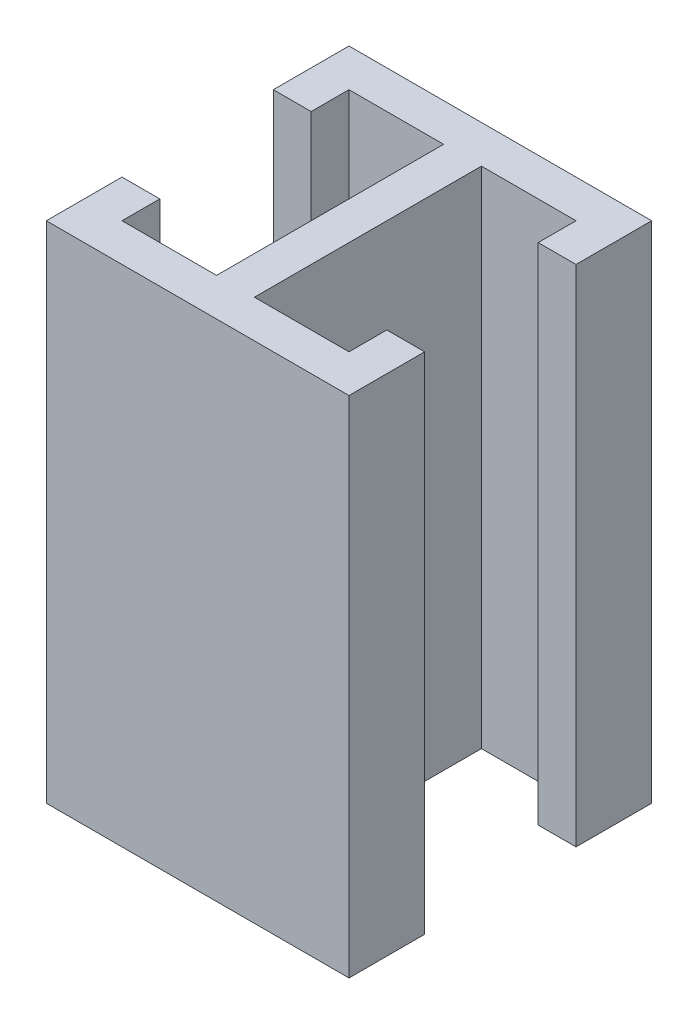
ISO-10303-21;
HEADER;
FILE_DESCRIPTION(('STEP AP214'),'2;1');
FILE_NAME('part.step','',(''),(''),'','','');
FILE_SCHEMA(('AUTOMOTIVE_DESIGN { 1 0 10303 214 1 1 1 1 }'));
ENDSEC;
DATA;
#1=APPLICATION_CONTEXT('core data for automotive mechanical design processes');
#2=APPLICATION_PROTOCOL_DEFINITION('international standard','automotive_design',2000,#1);
#3=PRODUCT_CONTEXT('',#1,'mechanical');
#4=PRODUCT('Part','Part','',(#3));
#5=PRODUCT_RELATED_PRODUCT_CATEGORY('part','',(#4));
#6=PRODUCT_DEFINITION_FORMATION('','',#4);
#7=PRODUCT_DEFINITION_CONTEXT('part definition',#1,'design');
#8=PRODUCT_DEFINITION('design','',#6,#7);
#9=PRODUCT_DEFINITION_SHAPE('','',#8);
#10=(LENGTH_UNIT() NAMED_UNIT(*) SI_UNIT(.MILLI.,.METRE.));
#11=(NAMED_UNIT(*) PLANE_ANGLE_UNIT() SI_UNIT($,.RADIAN.));
#12=(NAMED_UNIT(*) SI_UNIT($,.STERADIAN.) SOLID_ANGLE_UNIT());
#13=UNCERTAINTY_MEASURE_WITH_UNIT(LENGTH_MEASURE(1.E-05),#10,'distance_accuracy_value','');
#14=(GEOMETRIC_REPRESENTATION_CONTEXT(3) GLOBAL_UNCERTAINTY_ASSIGNED_CONTEXT((#13)) GLOBAL_UNIT_ASSIGNED_CONTEXT((#10,
#11,#12)) REPRESENTATION_CONTEXT('',''));
#15=CARTESIAN_POINT('',(0.,0.,0.));
#16=DIRECTION('',(0.,0.,1.));
#17=DIRECTION('',(1.,0.,0.));
#18=AXIS2_PLACEMENT_3D('',#15,#16,#17);
#19=CARTESIAN_POINT('',(0.,200.,0.));
#20=DIRECTION('',(1.,0.,0.));
#21=DIRECTION('',(0.,0.,-1.));
#22=AXIS2_PLACEMENT_3D('',#19,#20,#21);
#23=PLANE('',#22);
#24=DIRECTION('',(0.,0.,1.));
#25=VECTOR('',#24,1.);
#26=CARTESIAN_POINT('',(0.,0.,0.));
#27=LINE('',#26,#25);
#28=CARTESIAN_POINT('',(0.,0.,-30.));
#29=VERTEX_POINT('',#28);
#30=CARTESIAN_POINT('',(0.,0.,0.));
#31=VERTEX_POINT('',#30);
#32=EDGE_CURVE('E206',#29,#31,#27,.T.);
#33=ORIENTED_EDGE('',*,*,#32,.T.);
#34=DIRECTION('',(0.,-1.,0.));
#35=VECTOR('',#34,1.);
#36=CARTESIAN_POINT('',(0.,200.,0.));
#37=LINE('',#36,#35);
#38=CARTESIAN_POINT('',(0.,200.,0.));
#39=VERTEX_POINT('',#38);
#40=EDGE_CURVE('E11',#39,#31,#37,.T.);
#41=ORIENTED_EDGE('',*,*,#40,.F.);
#42=DIRECTION('',(0.,0.,1.));
#43=VECTOR('',#42,1.);
#44=CARTESIAN_POINT('',(0.,200.,0.));
#45=LINE('',#44,#43);
#46=CARTESIAN_POINT('',(0.,200.,-30.));
#47=VERTEX_POINT('',#46);
#48=EDGE_CURVE('E244',#47,#39,#45,.T.);
#49=ORIENTED_EDGE('',*,*,#48,.F.);
#50=DIRECTION('',(0.,-1.,0.));
#51=VECTOR('',#50,1.);
#52=CARTESIAN_POINT('',(0.,200.,-30.));
#53=LINE('',#52,#51);
#54=EDGE_CURVE('E202',#47,#29,#53,.T.);
#55=ORIENTED_EDGE('',*,*,#54,.T.);
#56=EDGE_LOOP('',(#33,#41,#49,#55));
#57=FACE_BOUND('',#56,.T.);
#58=ADVANCED_FACE('F38',(#57),#23,.F.);
#59=CARTESIAN_POINT('',(0.,200.,0.));
#60=DIRECTION('',(0.,0.,-1.));
#61=DIRECTION('',(-1.,0.,0.));
#62=AXIS2_PLACEMENT_3D('',#59,#60,#61);
#63=PLANE('',#62);
#64=DIRECTION('',(1.,0.,0.));
#65=VECTOR('',#64,1.);
#66=CARTESIAN_POINT('',(0.,0.,0.));
#67=LINE('',#66,#65);
#68=CARTESIAN_POINT('',(120.,0.,0.));
#69=VERTEX_POINT('',#68);
#70=EDGE_CURVE('E209',#31,#69,#67,.T.);
#71=ORIENTED_EDGE('',*,*,#70,.T.);
#72=DIRECTION('',(0.,-1.,0.));
#73=VECTOR('',#72,1.);
#74=CARTESIAN_POINT('',(120.,200.,0.));
#75=LINE('',#74,#73);
#76=CARTESIAN_POINT('',(120.,200.,0.));
#77=VERTEX_POINT('',#76);
#78=EDGE_CURVE('E46',#77,#69,#75,.T.);
#79=ORIENTED_EDGE('',*,*,#78,.F.);
#80=DIRECTION('',(1.,0.,0.));
#81=VECTOR('',#80,1.);
#82=CARTESIAN_POINT('',(0.,200.,0.));
#83=LINE('',#82,#81);
#84=EDGE_CURVE('E133',#39,#77,#83,.T.);
#85=ORIENTED_EDGE('',*,*,#84,.F.);
#86=ORIENTED_EDGE('',*,*,#40,.T.);
#87=EDGE_LOOP('',(#71,#79,#85,#86));
#88=FACE_BOUND('',#87,.T.);
#89=ADVANCED_FACE('F362',(#88),#63,.F.);
#90=CARTESIAN_POINT('',(120.,200.,0.));
#91=DIRECTION('',(-1.,0.,0.));
#92=DIRECTION('',(0.,0.,1.));
#93=AXIS2_PLACEMENT_3D('',#90,#91,#92);
#94=PLANE('',#93);
#95=DIRECTION('',(0.,0.,-1.));
#96=VECTOR('',#95,1.);
#97=CARTESIAN_POINT('',(120.,0.,0.));
#98=LINE('',#97,#96);
#99=CARTESIAN_POINT('',(120.,0.,-30.));
#100=VERTEX_POINT('',#99);
#101=EDGE_CURVE('E211',#69,#100,#98,.T.);
#102=ORIENTED_EDGE('',*,*,#101,.T.);
#103=DIRECTION('',(0.,-1.,0.));
#104=VECTOR('',#103,1.);
#105=CARTESIAN_POINT('',(120.,200.,-30.));
#106=LINE('',#105,#104);
#107=CARTESIAN_POINT('',(120.,200.,-30.));
#108=VERTEX_POINT('',#107);
#109=EDGE_CURVE('E287',#108,#100,#106,.T.);
#110=ORIENTED_EDGE('',*,*,#109,.F.);
#111=DIRECTION('',(0.,0.,-1.));
#112=VECTOR('',#111,1.);
#113=CARTESIAN_POINT('',(120.,200.,0.));
#114=LINE('',#113,#112);
#115=EDGE_CURVE('E295',#77,#108,#114,.T.);
#116=ORIENTED_EDGE('',*,*,#115,.F.);
#117=ORIENTED_EDGE('',*,*,#78,.T.);
#118=EDGE_LOOP('',(#102,#110,#116,#117));
#119=FACE_BOUND('',#118,.T.);
#120=ADVANCED_FACE('F293',(#119),#94,.F.);
#121=CARTESIAN_POINT('',(105.,200.,-30.));
#122=DIRECTION('',(0.,0.,1.));
#123=DIRECTION('',(1.,0.,0.));
#124=AXIS2_PLACEMENT_3D('',#121,#122,#123);
#125=PLANE('',#124);
#126=DIRECTION('',(-1.,0.,0.));
#127=VECTOR('',#126,1.);
#128=CARTESIAN_POINT('',(105.,0.,-30.));
#129=LINE('',#128,#127);
#130=CARTESIAN_POINT('',(105.,0.,-30.));
#131=VERTEX_POINT('',#130);
#132=EDGE_CURVE('E213',#100,#131,#129,.T.);
#133=ORIENTED_EDGE('',*,*,#132,.T.);
#134=DIRECTION('',(0.,-1.,0.));
#135=VECTOR('',#134,1.);
#136=CARTESIAN_POINT('',(105.,200.,-30.));
#137=LINE('',#136,#135);
#138=CARTESIAN_POINT('',(105.,200.,-30.));
#139=VERTEX_POINT('',#138);
#140=EDGE_CURVE('E284',#139,#131,#137,.T.);
#141=ORIENTED_EDGE('',*,*,#140,.F.);
#142=DIRECTION('',(-1.,0.,0.));
#143=VECTOR('',#142,1.);
#144=CARTESIAN_POINT('',(105.,200.,-30.));
#145=LINE('',#144,#143);
#146=EDGE_CURVE('E313',#108,#139,#145,.T.);
#147=ORIENTED_EDGE('',*,*,#146,.F.);
#148=ORIENTED_EDGE('',*,*,#109,.T.);
#149=EDGE_LOOP('',(#133,#141,#147,#148));
#150=FACE_BOUND('',#149,.T.);
#151=ADVANCED_FACE('F304',(#150),#125,.F.);
#152=CARTESIAN_POINT('',(105.,200.,-30.));
#153=DIRECTION('',(1.,0.,0.));
#154=DIRECTION('',(0.,0.,-1.));
#155=AXIS2_PLACEMENT_3D('',#152,#153,#154);
#156=PLANE('',#155);
#157=DIRECTION('',(0.,0.,1.));
#158=VECTOR('',#157,1.);
#159=CARTESIAN_POINT('',(105.,0.,-30.));
#160=LINE('',#159,#158);
#161=CARTESIAN_POINT('',(105.,0.,-15.));
#162=VERTEX_POINT('',#161);
#163=EDGE_CURVE('E215',#131,#162,#160,.T.);
#164=ORIENTED_EDGE('',*,*,#163,.T.);
#165=DIRECTION('',(0.,-1.,0.));
#166=VECTOR('',#165,1.);
#167=CARTESIAN_POINT('',(105.,200.,-15.));
#168=LINE('',#167,#166);
#169=CARTESIAN_POINT('',(105.,200.,-15.));
#170=VERTEX_POINT('',#169);
#171=EDGE_CURVE('E281',#170,#162,#168,.T.);
#172=ORIENTED_EDGE('',*,*,#171,.F.);
#173=DIRECTION('',(0.,0.,1.));
#174=VECTOR('',#173,1.);
#175=CARTESIAN_POINT('',(105.,200.,-30.));
#176=LINE('',#175,#174);
#177=EDGE_CURVE('E310',#139,#170,#176,.T.);
#178=ORIENTED_EDGE('',*,*,#177,.F.);
#179=ORIENTED_EDGE('',*,*,#140,.T.);
#180=EDGE_LOOP('',(#164,#172,#178,#179));
#181=FACE_BOUND('',#180,.T.);
#182=ADVANCED_FACE('F308',(#181),#156,.F.);
#183=CARTESIAN_POINT('',(67.5,200.,-15.));
#184=DIRECTION('',(0.,0.,1.));
#185=DIRECTION('',(1.,0.,0.));
#186=AXIS2_PLACEMENT_3D('',#183,#184,#185);
#187=PLANE('',#186);
#188=DIRECTION('',(-1.,0.,0.));
#189=VECTOR('',#188,1.);
#190=CARTESIAN_POINT('',(67.5,0.,-15.));
#191=LINE('',#190,#189);
#192=CARTESIAN_POINT('',(67.5,0.,-15.));
#193=VERTEX_POINT('',#192);
#194=EDGE_CURVE('E217',#162,#193,#191,.T.);
#195=ORIENTED_EDGE('',*,*,#194,.T.);
#196=DIRECTION('',(0.,-1.,0.));
#197=VECTOR('',#196,1.);
#198=CARTESIAN_POINT('',(67.5,200.,-15.));
#199=LINE('',#198,#197);
#200=CARTESIAN_POINT('',(67.5,200.,-15.));
#201=VERTEX_POINT('',#200);
#202=EDGE_CURVE('E278',#201,#193,#199,.T.);
#203=ORIENTED_EDGE('',*,*,#202,.F.);
#204=DIRECTION('',(-1.,0.,0.));
#205=VECTOR('',#204,1.);
#206=CARTESIAN_POINT('',(67.5,200.,-15.));
#207=LINE('',#206,#205);
#208=EDGE_CURVE('E312',#170,#201,#207,.T.);
#209=ORIENTED_EDGE('',*,*,#208,.F.);
#210=ORIENTED_EDGE('',*,*,#171,.T.);
#211=EDGE_LOOP('',(#195,#203,#209,#210));
#212=FACE_BOUND('',#211,.T.);
#213=ADVANCED_FACE('F375',(#212),#187,.F.);
#214=CARTESIAN_POINT('',(67.5,200.,-105.));
#215=DIRECTION('',(-1.,0.,0.));
#216=DIRECTION('',(0.,0.,1.));
#217=AXIS2_PLACEMENT_3D('',#214,#215,#216);
#218=PLANE('',#217);
#219=DIRECTION('',(0.,0.,-1.));
#220=VECTOR('',#219,1.);
#221=CARTESIAN_POINT('',(67.5,0.,-105.));
#222=LINE('',#221,#220);
#223=CARTESIAN_POINT('',(67.5,0.,-105.));
#224=VERTEX_POINT('',#223);
#225=EDGE_CURVE('E219',#193,#224,#222,.T.);
#226=ORIENTED_EDGE('',*,*,#225,.T.);
#227=DIRECTION('',(0.,-1.,0.));
#228=VECTOR('',#227,1.);
#229=CARTESIAN_POINT('',(67.5,200.,-105.));
#230=LINE('',#229,#228);
#231=CARTESIAN_POINT('',(67.5,200.,-105.));
#232=VERTEX_POINT('',#231);
#233=EDGE_CURVE('E275',#232,#224,#230,.T.);
#234=ORIENTED_EDGE('',*,*,#233,.F.);
#235=DIRECTION('',(0.,0.,-1.));
#236=VECTOR('',#235,1.);
#237=CARTESIAN_POINT('',(67.5,200.,-105.));
#238=LINE('',#237,#236);
#239=EDGE_CURVE('E315',#201,#232,#238,.T.);
#240=ORIENTED_EDGE('',*,*,#239,.F.);
#241=ORIENTED_EDGE('',*,*,#202,.T.);
#242=EDGE_LOOP('',(#226,#234,#240,#241));
#243=FACE_BOUND('',#242,.T.);
#244=ADVANCED_FACE('F378',(#243),#218,.F.);
#245=CARTESIAN_POINT('',(67.5,200.,-105.));
#246=DIRECTION('',(0.,0.,-1.));
#247=DIRECTION('',(-1.,0.,0.));
#248=AXIS2_PLACEMENT_3D('',#245,#246,#247);
#249=PLANE('',#248);
#250=DIRECTION('',(1.,0.,0.));
#251=VECTOR('',#250,1.);
#252=CARTESIAN_POINT('',(67.5,0.,-105.));
#253=LINE('',#252,#251);
#254=CARTESIAN_POINT('',(105.,0.,-105.));
#255=VERTEX_POINT('',#254);
#256=EDGE_CURVE('E221',#224,#255,#253,.T.);
#257=ORIENTED_EDGE('',*,*,#256,.T.);
#258=DIRECTION('',(0.,-1.,0.));
#259=VECTOR('',#258,1.);
#260=CARTESIAN_POINT('',(105.,200.,-105.));
#261=LINE('',#260,#259);
#262=CARTESIAN_POINT('',(105.,200.,-105.));
#263=VERTEX_POINT('',#262);
#264=EDGE_CURVE('E272',#263,#255,#261,.T.);
#265=ORIENTED_EDGE('',*,*,#264,.F.);
#266=DIRECTION('',(1.,0.,0.));
#267=VECTOR('',#266,1.);
#268=CARTESIAN_POINT('',(67.5,200.,-105.));
#269=LINE('',#268,#267);
#270=EDGE_CURVE('E321',#232,#263,#269,.T.);
#271=ORIENTED_EDGE('',*,*,#270,.F.);
#272=ORIENTED_EDGE('',*,*,#233,.T.);
#273=EDGE_LOOP('',(#257,#265,#271,#272));
#274=FACE_BOUND('',#273,.T.);
#275=ADVANCED_FACE('F382',(#274),#249,.F.);
#276=CARTESIAN_POINT('',(105.,200.,-105.));
#277=DIRECTION('',(1.,0.,0.));
#278=DIRECTION('',(0.,0.,-1.));
#279=AXIS2_PLACEMENT_3D('',#276,#277,#278);
#280=PLANE('',#279);
#281=DIRECTION('',(0.,0.,1.));
#282=VECTOR('',#281,1.);
#283=CARTESIAN_POINT('',(105.,0.,-105.));
#284=LINE('',#283,#282);
#285=CARTESIAN_POINT('',(105.,0.,-90.));
#286=VERTEX_POINT('',#285);
#287=EDGE_CURVE('E223',#255,#286,#284,.T.);
#288=ORIENTED_EDGE('',*,*,#287,.T.);
#289=DIRECTION('',(0.,-1.,0.));
#290=VECTOR('',#289,1.);
#291=CARTESIAN_POINT('',(105.,200.,-90.));
#292=LINE('',#291,#290);
#293=CARTESIAN_POINT('',(105.,200.,-90.));
#294=VERTEX_POINT('',#293);
#295=EDGE_CURVE('E269',#294,#286,#292,.T.);
#296=ORIENTED_EDGE('',*,*,#295,.F.);
#297=DIRECTION('',(0.,0.,1.));
#298=VECTOR('',#297,1.);
#299=CARTESIAN_POINT('',(105.,200.,-105.));
#300=LINE('',#299,#298);
#301=EDGE_CURVE('E323',#263,#294,#300,.T.);
#302=ORIENTED_EDGE('',*,*,#301,.F.);
#303=ORIENTED_EDGE('',*,*,#264,.T.);
#304=EDGE_LOOP('',(#288,#296,#302,#303));
#305=FACE_BOUND('',#304,.T.);
#306=ADVANCED_FACE('F386',(#305),#280,.F.);
#307=CARTESIAN_POINT('',(105.,200.,-90.));
#308=DIRECTION('',(0.,0.,-1.));
#309=DIRECTION('',(-1.,0.,0.));
#310=AXIS2_PLACEMENT_3D('',#307,#308,#309);
#311=PLANE('',#310);
#312=DIRECTION('',(1.,0.,0.));
#313=VECTOR('',#312,1.);
#314=CARTESIAN_POINT('',(105.,0.,-90.));
#315=LINE('',#314,#313);
#316=CARTESIAN_POINT('',(120.,0.,-90.));
#317=VERTEX_POINT('',#316);
#318=EDGE_CURVE('E225',#286,#317,#315,.T.);
#319=ORIENTED_EDGE('',*,*,#318,.T.);
#320=DIRECTION('',(0.,-1.,0.));
#321=VECTOR('',#320,1.);
#322=CARTESIAN_POINT('',(120.,200.,-90.));
#323=LINE('',#322,#321);
#324=CARTESIAN_POINT('',(120.,200.,-90.));
#325=VERTEX_POINT('',#324);
#326=EDGE_CURVE('E266',#325,#317,#323,.T.);
#327=ORIENTED_EDGE('',*,*,#326,.F.);
#328=DIRECTION('',(1.,0.,0.));
#329=VECTOR('',#328,1.);
#330=CARTESIAN_POINT('',(105.,200.,-90.));
#331=LINE('',#330,#329);
#332=EDGE_CURVE('E325',#294,#325,#331,.T.);
#333=ORIENTED_EDGE('',*,*,#332,.F.);
#334=ORIENTED_EDGE('',*,*,#295,.T.);
#335=EDGE_LOOP('',(#319,#327,#333,#334));
#336=FACE_BOUND('',#335,.T.);
#337=ADVANCED_FACE('F390',(#336),#311,.F.);
#338=CARTESIAN_POINT('',(120.,200.,-90.));
#339=DIRECTION('',(-1.,0.,0.));
#340=DIRECTION('',(0.,0.,1.));
#341=AXIS2_PLACEMENT_3D('',#338,#339,#340);
#342=PLANE('',#341);
#343=DIRECTION('',(0.,0.,-1.));
#344=VECTOR('',#343,1.);
#345=CARTESIAN_POINT('',(120.,0.,-90.));
#346=LINE('',#345,#344);
#347=CARTESIAN_POINT('',(120.,0.,-120.));
#348=VERTEX_POINT('',#347);
#349=EDGE_CURVE('E227',#317,#348,#346,.T.);
#350=ORIENTED_EDGE('',*,*,#349,.T.);
#351=DIRECTION('',(0.,-1.,0.));
#352=VECTOR('',#351,1.);
#353=CARTESIAN_POINT('',(120.,200.,-120.));
#354=LINE('',#353,#352);
#355=CARTESIAN_POINT('',(120.,200.,-120.));
#356=VERTEX_POINT('',#355);
#357=EDGE_CURVE('E263',#356,#348,#354,.T.);
#358=ORIENTED_EDGE('',*,*,#357,.F.);
#359=DIRECTION('',(0.,0.,-1.));
#360=VECTOR('',#359,1.);
#361=CARTESIAN_POINT('',(120.,200.,-90.));
#362=LINE('',#361,#360);
#363=EDGE_CURVE('E327',#325,#356,#362,.T.);
#364=ORIENTED_EDGE('',*,*,#363,.F.);
#365=ORIENTED_EDGE('',*,*,#326,.T.);
#366=EDGE_LOOP('',(#350,#358,#364,#365));
#367=FACE_BOUND('',#366,.T.);
#368=ADVANCED_FACE('F394',(#367),#342,.F.);
#369=CARTESIAN_POINT('',(0.,200.,-120.));
#370=DIRECTION('',(0.,0.,1.));
#371=DIRECTION('',(1.,0.,0.));
#372=AXIS2_PLACEMENT_3D('',#369,#370,#371);
#373=PLANE('',#372);
#374=DIRECTION('',(-1.,0.,0.));
#375=VECTOR('',#374,1.);
#376=CARTESIAN_POINT('',(0.,0.,-120.));
#377=LINE('',#376,#375);
#378=CARTESIAN_POINT('',(0.,0.,-120.));
#379=VERTEX_POINT('',#378);
#380=EDGE_CURVE('E229',#348,#379,#377,.T.);
#381=ORIENTED_EDGE('',*,*,#380,.T.);
#382=DIRECTION('',(0.,-1.,0.));
#383=VECTOR('',#382,1.);
#384=CARTESIAN_POINT('',(0.,200.,-120.));
#385=LINE('',#384,#383);
#386=CARTESIAN_POINT('',(0.,200.,-120.));
#387=VERTEX_POINT('',#386);
#388=EDGE_CURVE('E260',#387,#379,#385,.T.);
#389=ORIENTED_EDGE('',*,*,#388,.F.);
#390=DIRECTION('',(-1.,0.,0.));
#391=VECTOR('',#390,1.);
#392=CARTESIAN_POINT('',(0.,200.,-120.));
#393=LINE('',#392,#391);
#394=EDGE_CURVE('E329',#356,#387,#393,.T.);
#395=ORIENTED_EDGE('',*,*,#394,.F.);
#396=ORIENTED_EDGE('',*,*,#357,.T.);
#397=EDGE_LOOP('',(#381,#389,#395,#396));
#398=FACE_BOUND('',#397,.T.);
#399=ADVANCED_FACE('F398',(#398),#373,.F.);
#400=CARTESIAN_POINT('',(0.,200.,-90.));
#401=DIRECTION('',(1.,0.,0.));
#402=DIRECTION('',(0.,0.,-1.));
#403=AXIS2_PLACEMENT_3D('',#400,#401,#402);
#404=PLANE('',#403);
#405=DIRECTION('',(0.,0.,1.));
#406=VECTOR('',#405,1.);
#407=CARTESIAN_POINT('',(0.,0.,-90.));
#408=LINE('',#407,#406);
#409=CARTESIAN_POINT('',(0.,0.,-90.));
#410=VERTEX_POINT('',#409);
#411=EDGE_CURVE('E231',#379,#410,#408,.T.);
#412=ORIENTED_EDGE('',*,*,#411,.T.);
#413=DIRECTION('',(0.,-1.,0.));
#414=VECTOR('',#413,1.);
#415=CARTESIAN_POINT('',(0.,200.,-90.));
#416=LINE('',#415,#414);
#417=CARTESIAN_POINT('',(0.,200.,-90.));
#418=VERTEX_POINT('',#417);
#419=EDGE_CURVE('E257',#418,#410,#416,.T.);
#420=ORIENTED_EDGE('',*,*,#419,.F.);
#421=DIRECTION('',(0.,0.,1.));
#422=VECTOR('',#421,1.);
#423=CARTESIAN_POINT('',(0.,200.,-90.));
#424=LINE('',#423,#422);
#425=EDGE_CURVE('E331',#387,#418,#424,.T.);
#426=ORIENTED_EDGE('',*,*,#425,.F.);
#427=ORIENTED_EDGE('',*,*,#388,.T.);
#428=EDGE_LOOP('',(#412,#420,#426,#427));
#429=FACE_BOUND('',#428,.T.);
#430=ADVANCED_FACE('F402',(#429),#404,.F.);
#431=CARTESIAN_POINT('',(15.,200.,-90.));
#432=DIRECTION('',(0.,0.,-1.));
#433=DIRECTION('',(-1.,0.,0.));
#434=AXIS2_PLACEMENT_3D('',#431,#432,#433);
#435=PLANE('',#434);
#436=DIRECTION('',(1.,0.,0.));
#437=VECTOR('',#436,1.);
#438=CARTESIAN_POINT('',(15.,0.,-90.));
#439=LINE('',#438,#437);
#440=CARTESIAN_POINT('',(15.,0.,-90.));
#441=VERTEX_POINT('',#440);
#442=EDGE_CURVE('E233',#410,#441,#439,.T.);
#443=ORIENTED_EDGE('',*,*,#442,.T.);
#444=DIRECTION('',(0.,-1.,0.));
#445=VECTOR('',#444,1.);
#446=CARTESIAN_POINT('',(15.,200.,-90.));
#447=LINE('',#446,#445);
#448=CARTESIAN_POINT('',(15.,200.,-90.));
#449=VERTEX_POINT('',#448);
#450=EDGE_CURVE('E254',#449,#441,#447,.T.);
#451=ORIENTED_EDGE('',*,*,#450,.F.);
#452=DIRECTION('',(1.,0.,0.));
#453=VECTOR('',#452,1.);
#454=CARTESIAN_POINT('',(15.,200.,-90.));
#455=LINE('',#454,#453);
#456=EDGE_CURVE('E333',#418,#449,#455,.T.);
#457=ORIENTED_EDGE('',*,*,#456,.F.);
#458=ORIENTED_EDGE('',*,*,#419,.T.);
#459=EDGE_LOOP('',(#443,#451,#457,#458));
#460=FACE_BOUND('',#459,.T.);
#461=ADVANCED_FACE('F406',(#460),#435,.F.);
#462=CARTESIAN_POINT('',(15.,200.,-105.));
#463=DIRECTION('',(-1.,0.,0.));
#464=DIRECTION('',(0.,0.,1.));
#465=AXIS2_PLACEMENT_3D('',#462,#463,#464);
#466=PLANE('',#465);
#467=DIRECTION('',(0.,0.,-1.));
#468=VECTOR('',#467,1.);
#469=CARTESIAN_POINT('',(15.,0.,-105.));
#470=LINE('',#469,#468);
#471=CARTESIAN_POINT('',(15.,0.,-105.));
#472=VERTEX_POINT('',#471);
#473=EDGE_CURVE('E235',#441,#472,#470,.T.);
#474=ORIENTED_EDGE('',*,*,#473,.T.);
#475=DIRECTION('',(0.,-1.,0.));
#476=VECTOR('',#475,1.);
#477=CARTESIAN_POINT('',(15.,200.,-105.));
#478=LINE('',#477,#476);
#479=CARTESIAN_POINT('',(15.,200.,-105.));
#480=VERTEX_POINT('',#479);
#481=EDGE_CURVE('E251',#480,#472,#478,.T.);
#482=ORIENTED_EDGE('',*,*,#481,.F.);
#483=DIRECTION('',(0.,0.,-1.));
#484=VECTOR('',#483,1.);
#485=CARTESIAN_POINT('',(15.,200.,-105.));
#486=LINE('',#485,#484);
#487=EDGE_CURVE('E335',#449,#480,#486,.T.);
#488=ORIENTED_EDGE('',*,*,#487,.F.);
#489=ORIENTED_EDGE('',*,*,#450,.T.);
#490=EDGE_LOOP('',(#474,#482,#488,#489));
#491=FACE_BOUND('',#490,.T.);
#492=ADVANCED_FACE('F410',(#491),#466,.F.);
#493=CARTESIAN_POINT('',(52.5,200.,-105.));
#494=DIRECTION('',(0.,0.,-1.));
#495=DIRECTION('',(-1.,0.,0.));
#496=AXIS2_PLACEMENT_3D('',#493,#494,#495);
#497=PLANE('',#496);
#498=DIRECTION('',(1.,0.,0.));
#499=VECTOR('',#498,1.);
#500=CARTESIAN_POINT('',(52.5,0.,-105.));
#501=LINE('',#500,#499);
#502=CARTESIAN_POINT('',(52.5,0.,-105.));
#503=VERTEX_POINT('',#502);
#504=EDGE_CURVE('E237',#472,#503,#501,.T.);
#505=ORIENTED_EDGE('',*,*,#504,.T.);
#506=DIRECTION('',(0.,-1.,0.));
#507=VECTOR('',#506,1.);
#508=CARTESIAN_POINT('',(52.5,200.,-105.));
#509=LINE('',#508,#507);
#510=CARTESIAN_POINT('',(52.5,200.,-105.));
#511=VERTEX_POINT('',#510);
#512=EDGE_CURVE('E248',#511,#503,#509,.T.);
#513=ORIENTED_EDGE('',*,*,#512,.F.);
#514=DIRECTION('',(1.,0.,0.));
#515=VECTOR('',#514,1.);
#516=CARTESIAN_POINT('',(52.5,200.,-105.));
#517=LINE('',#516,#515);
#518=EDGE_CURVE('E337',#480,#511,#517,.T.);
#519=ORIENTED_EDGE('',*,*,#518,.F.);
#520=ORIENTED_EDGE('',*,*,#481,.T.);
#521=EDGE_LOOP('',(#505,#513,#519,#520));
#522=FACE_BOUND('',#521,.T.);
#523=ADVANCED_FACE('F343',(#522),#497,.F.);
#524=CARTESIAN_POINT('',(52.5,200.,-105.));
#525=DIRECTION('',(1.,0.,0.));
#526=DIRECTION('',(0.,0.,-1.));
#527=AXIS2_PLACEMENT_3D('',#524,#525,#526);
#528=PLANE('',#527);
#529=DIRECTION('',(0.,0.,1.));
#530=VECTOR('',#529,1.);
#531=CARTESIAN_POINT('',(52.5,0.,-105.));
#532=LINE('',#531,#530);
#533=CARTESIAN_POINT('',(52.5,0.,-15.));
#534=VERTEX_POINT('',#533);
#535=EDGE_CURVE('E239',#503,#534,#532,.T.);
#536=ORIENTED_EDGE('',*,*,#535,.T.);
#537=DIRECTION('',(0.,-1.,0.));
#538=VECTOR('',#537,1.);
#539=CARTESIAN_POINT('',(52.5,200.,-15.));
#540=LINE('',#539,#538);
#541=CARTESIAN_POINT('',(52.5,200.,-15.));
#542=VERTEX_POINT('',#541);
#543=EDGE_CURVE('E197',#542,#534,#540,.T.);
#544=ORIENTED_EDGE('',*,*,#543,.F.);
#545=DIRECTION('',(0.,0.,1.));
#546=VECTOR('',#545,1.);
#547=CARTESIAN_POINT('',(52.5,200.,-105.));
#548=LINE('',#547,#546);
#549=EDGE_CURVE('E188',#511,#542,#548,.T.);
#550=ORIENTED_EDGE('',*,*,#549,.F.);
#551=ORIENTED_EDGE('',*,*,#512,.T.);
#552=EDGE_LOOP('',(#536,#544,#550,#551));
#553=FACE_BOUND('',#552,.T.);
#554=ADVANCED_FACE('F347',(#553),#528,.F.);
#555=CARTESIAN_POINT('',(52.5,200.,-15.));
#556=DIRECTION('',(0.,0.,1.));
#557=DIRECTION('',(1.,0.,0.));
#558=AXIS2_PLACEMENT_3D('',#555,#556,#557);
#559=PLANE('',#558);
#560=DIRECTION('',(-1.,0.,0.));
#561=VECTOR('',#560,1.);
#562=CARTESIAN_POINT('',(52.5,0.,-15.));
#563=LINE('',#562,#561);
#564=CARTESIAN_POINT('',(15.,0.,-15.));
#565=VERTEX_POINT('',#564);
#566=EDGE_CURVE('E196',#534,#565,#563,.T.);
#567=ORIENTED_EDGE('',*,*,#566,.T.);
#568=DIRECTION('',(0.,-1.,0.));
#569=VECTOR('',#568,1.);
#570=CARTESIAN_POINT('',(15.,200.,-15.));
#571=LINE('',#570,#569);
#572=CARTESIAN_POINT('',(15.,200.,-15.));
#573=VERTEX_POINT('',#572);
#574=EDGE_CURVE('E193',#573,#565,#571,.T.);
#575=ORIENTED_EDGE('',*,*,#574,.F.);
#576=DIRECTION('',(-1.,0.,0.));
#577=VECTOR('',#576,1.);
#578=CARTESIAN_POINT('',(52.5,200.,-15.));
#579=LINE('',#578,#577);
#580=EDGE_CURVE('E182',#542,#573,#579,.T.);
#581=ORIENTED_EDGE('',*,*,#580,.F.);
#582=ORIENTED_EDGE('',*,*,#543,.T.);
#583=EDGE_LOOP('',(#567,#575,#581,#582));
#584=FACE_BOUND('',#583,.T.);
#585=ADVANCED_FACE('F194',(#584),#559,.F.);
#586=CARTESIAN_POINT('',(15.,200.,-30.));
#587=DIRECTION('',(-1.,0.,0.));
#588=DIRECTION('',(0.,0.,1.));
#589=AXIS2_PLACEMENT_3D('',#586,#587,#588);
#590=PLANE('',#589);
#591=DIRECTION('',(0.,0.,-1.));
#592=VECTOR('',#591,1.);
#593=CARTESIAN_POINT('',(15.,0.,-30.));
#594=LINE('',#593,#592);
#595=CARTESIAN_POINT('',(15.,0.,-30.));
#596=VERTEX_POINT('',#595);
#597=EDGE_CURVE('E119',#565,#596,#594,.T.);
#598=ORIENTED_EDGE('',*,*,#597,.T.);
#599=DIRECTION('',(0.,-1.,0.));
#600=VECTOR('',#599,1.);
#601=CARTESIAN_POINT('',(15.,200.,-30.));
#602=LINE('',#601,#600);
#603=CARTESIAN_POINT('',(15.,200.,-30.));
#604=VERTEX_POINT('',#603);
#605=EDGE_CURVE('E198',#604,#596,#602,.T.);
#606=ORIENTED_EDGE('',*,*,#605,.F.);
#607=DIRECTION('',(0.,0.,-1.));
#608=VECTOR('',#607,1.);
#609=CARTESIAN_POINT('',(15.,200.,-30.));
#610=LINE('',#609,#608);
#611=EDGE_CURVE('E186',#573,#604,#610,.T.);
#612=ORIENTED_EDGE('',*,*,#611,.F.);
#613=ORIENTED_EDGE('',*,*,#574,.T.);
#614=EDGE_LOOP('',(#598,#606,#612,#613));
#615=FACE_BOUND('',#614,.T.);
#616=ADVANCED_FACE('F200',(#615),#590,.F.);
#617=CARTESIAN_POINT('',(15.,200.,-30.));
#618=DIRECTION('',(0.,0.,1.));
#619=DIRECTION('',(1.,0.,0.));
#620=AXIS2_PLACEMENT_3D('',#617,#618,#619);
#621=PLANE('',#620);
#622=DIRECTION('',(-1.,0.,0.));
#623=VECTOR('',#622,1.);
#624=CARTESIAN_POINT('',(15.,0.,-30.));
#625=LINE('',#624,#623);
#626=EDGE_CURVE('E125',#596,#29,#625,.T.);
#627=ORIENTED_EDGE('',*,*,#626,.T.);
#628=ORIENTED_EDGE('',*,*,#54,.F.);
#629=DIRECTION('',(-1.,0.,0.));
#630=VECTOR('',#629,1.);
#631=CARTESIAN_POINT('',(15.,200.,-30.));
#632=LINE('',#631,#630);
#633=EDGE_CURVE('E54',#604,#47,#632,.T.);
#634=ORIENTED_EDGE('',*,*,#633,.F.);
#635=ORIENTED_EDGE('',*,*,#605,.T.);
#636=EDGE_LOOP('',(#627,#628,#634,#635));
#637=FACE_BOUND('',#636,.T.);
#638=ADVANCED_FACE('F351',(#637),#621,.F.);
#639=CARTESIAN_POINT('',(0.,200.,0.));
#640=DIRECTION('',(0.,1.,0.));
#641=DIRECTION('',(0.,0.,1.));
#642=AXIS2_PLACEMENT_3D('',#639,#640,#641);
#643=PLANE('',#642);
#644=ORIENTED_EDGE('',*,*,#48,.T.);
#645=ORIENTED_EDGE('',*,*,#84,.T.);
#646=ORIENTED_EDGE('',*,*,#115,.T.);
#647=ORIENTED_EDGE('',*,*,#146,.T.);
#648=ORIENTED_EDGE('',*,*,#177,.T.);
#649=ORIENTED_EDGE('',*,*,#208,.T.);
#650=ORIENTED_EDGE('',*,*,#239,.T.);
#651=ORIENTED_EDGE('',*,*,#270,.T.);
#652=ORIENTED_EDGE('',*,*,#301,.T.);
#653=ORIENTED_EDGE('',*,*,#332,.T.);
#654=ORIENTED_EDGE('',*,*,#363,.T.);
#655=ORIENTED_EDGE('',*,*,#394,.T.);
#656=ORIENTED_EDGE('',*,*,#425,.T.);
#657=ORIENTED_EDGE('',*,*,#456,.T.);
#658=ORIENTED_EDGE('',*,*,#487,.T.);
#659=ORIENTED_EDGE('',*,*,#518,.T.);
#660=ORIENTED_EDGE('',*,*,#549,.T.);
#661=ORIENTED_EDGE('',*,*,#580,.T.);
#662=ORIENTED_EDGE('',*,*,#611,.T.);
#663=ORIENTED_EDGE('',*,*,#633,.T.);
#664=EDGE_LOOP('',(#644,#645,#646,#647,#648,#649,#650,#651,#652,#653,#654,#655,#656,#657,#658,
#659,#660,#661,#662,#663));
#665=FACE_BOUND('',#664,.T.);
#666=ADVANCED_FACE('F184',(#665),#643,.T.);
#667=CARTESIAN_POINT('',(0.,0.,0.));
#668=DIRECTION('',(0.,1.,0.));
#669=DIRECTION('',(0.,0.,1.));
#670=AXIS2_PLACEMENT_3D('',#667,#668,#669);
#671=PLANE('',#670);
#672=ORIENTED_EDGE('',*,*,#32,.F.);
#673=ORIENTED_EDGE('',*,*,#626,.F.);
#674=ORIENTED_EDGE('',*,*,#597,.F.);
#675=ORIENTED_EDGE('',*,*,#566,.F.);
#676=ORIENTED_EDGE('',*,*,#535,.F.);
#677=ORIENTED_EDGE('',*,*,#504,.F.);
#678=ORIENTED_EDGE('',*,*,#473,.F.);
#679=ORIENTED_EDGE('',*,*,#442,.F.);
#680=ORIENTED_EDGE('',*,*,#411,.F.);
#681=ORIENTED_EDGE('',*,*,#380,.F.);
#682=ORIENTED_EDGE('',*,*,#349,.F.);
#683=ORIENTED_EDGE('',*,*,#318,.F.);
#684=ORIENTED_EDGE('',*,*,#287,.F.);
#685=ORIENTED_EDGE('',*,*,#256,.F.);
#686=ORIENTED_EDGE('',*,*,#225,.F.);
#687=ORIENTED_EDGE('',*,*,#194,.F.);
#688=ORIENTED_EDGE('',*,*,#163,.F.);
#689=ORIENTED_EDGE('',*,*,#132,.F.);
#690=ORIENTED_EDGE('',*,*,#101,.F.);
#691=ORIENTED_EDGE('',*,*,#70,.F.);
#692=EDGE_LOOP('',(#672,#673,#674,#675,#676,#677,#678,#679,#680,#681,#682,#683,#684,#685,#686,
#687,#688,#689,#690,#691));
#693=FACE_BOUND('',#692,.T.);
#694=ADVANCED_FACE('F299',(#693),#671,.F.);
#695=CLOSED_SHELL('',(#58,#89,#120,#151,#182,#213,#244,#275,#306,#337,#368,#399,#430,#461,#492,
#523,#554,#585,#616,#638,#666,#694));
#696=MANIFOLD_SOLID_BREP('B2',#695);
#697=ADVANCED_BREP_SHAPE_REPRESENTATION('',(#18,#696),#14);
#698=SHAPE_DEFINITION_REPRESENTATION(#9,#697);
ENDSEC;
END-ISO-10303-21;
